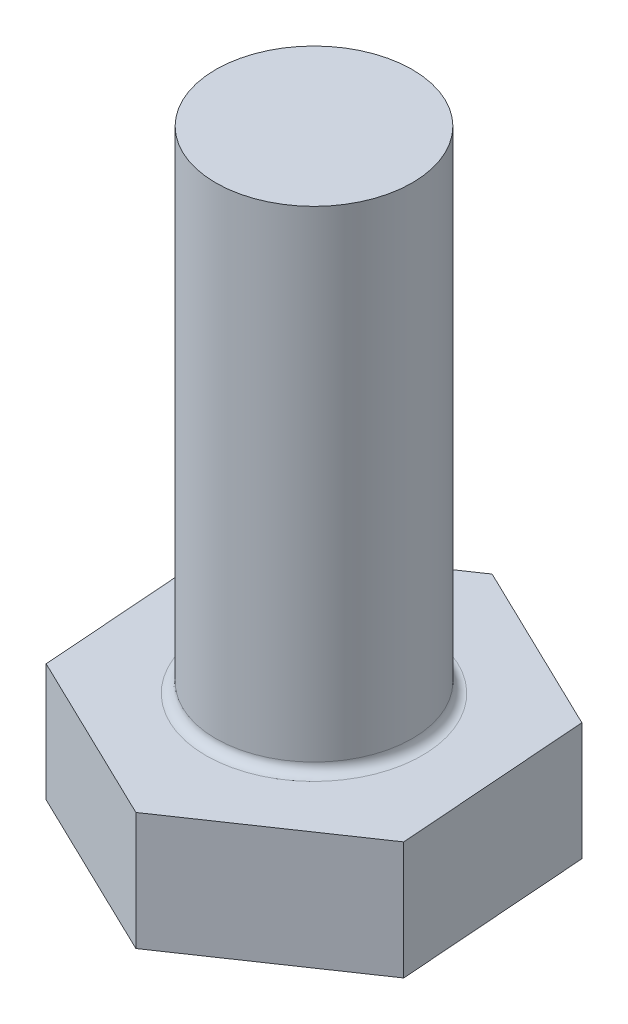
ISO-10303-21;
HEADER;
FILE_DESCRIPTION(('STEP AP214'),'2;1');
FILE_NAME('part.step','',(''),(''),'','','');
FILE_SCHEMA(('AUTOMOTIVE_DESIGN { 1 0 10303 214 1 1 1 1 }'));
ENDSEC;
DATA;
#1=APPLICATION_CONTEXT('core data for automotive mechanical design processes');
#2=APPLICATION_PROTOCOL_DEFINITION('international standard','automotive_design',2000,#1);
#3=PRODUCT_CONTEXT('',#1,'mechanical');
#4=PRODUCT('Part','Part','',(#3));
#5=PRODUCT_RELATED_PRODUCT_CATEGORY('part','',(#4));
#6=PRODUCT_DEFINITION_FORMATION('','',#4);
#7=PRODUCT_DEFINITION_CONTEXT('part definition',#1,'design');
#8=PRODUCT_DEFINITION('design','',#6,#7);
#9=PRODUCT_DEFINITION_SHAPE('','',#8);
#10=(LENGTH_UNIT() NAMED_UNIT(*) SI_UNIT(.MILLI.,.METRE.));
#11=(NAMED_UNIT(*) PLANE_ANGLE_UNIT() SI_UNIT($,.RADIAN.));
#12=(NAMED_UNIT(*) SI_UNIT($,.STERADIAN.) SOLID_ANGLE_UNIT());
#13=UNCERTAINTY_MEASURE_WITH_UNIT(LENGTH_MEASURE(1.E-05),#10,'distance_accuracy_value','');
#14=(GEOMETRIC_REPRESENTATION_CONTEXT(3) GLOBAL_UNCERTAINTY_ASSIGNED_CONTEXT((#13)) GLOBAL_UNIT_ASSIGNED_CONTEXT((#10,
#11,#12)) REPRESENTATION_CONTEXT('',''));
#15=CARTESIAN_POINT('',(0.,0.,0.));
#16=DIRECTION('',(0.,0.,1.));
#17=DIRECTION('',(1.,0.,0.));
#18=AXIS2_PLACEMENT_3D('',#15,#16,#17);
#19=CARTESIAN_POINT('',(0.,25.,0.));
#20=DIRECTION('',(0.,-1.,0.));
#21=DIRECTION('',(0.,0.,-1.));
#22=AXIS2_PLACEMENT_3D('',#19,#20,#21);
#23=CYLINDRICAL_SURFACE('',#22,5.);
#24=CARTESIAN_POINT('',(0.,0.5,0.));
#25=DIRECTION('',(0.,-1.,0.));
#26=DIRECTION('',(0.,0.,-1.));
#27=AXIS2_PLACEMENT_3D('',#24,#25,#26);
#28=CIRCLE('',#27,5.);
#29=CARTESIAN_POINT('',(0.,0.5,-5.));
#30=VERTEX_POINT('',#29);
#31=EDGE_CURVE('E43',#30,#30,#28,.F.);
#32=ORIENTED_EDGE('',*,*,#31,.T.);
#33=EDGE_LOOP('',(#32));
#34=FACE_BOUND('',#33,.T.);
#35=CARTESIAN_POINT('',(0.,25.,0.));
#36=DIRECTION('',(0.,1.,0.));
#37=DIRECTION('',(0.,0.,1.));
#38=AXIS2_PLACEMENT_3D('',#35,#36,#37);
#39=CIRCLE('',#38,5.);
#40=CARTESIAN_POINT('',(0.,25.,5.));
#41=VERTEX_POINT('',#40);
#42=EDGE_CURVE('E139',#41,#41,#39,.T.);
#43=ORIENTED_EDGE('',*,*,#42,.F.);
#44=EDGE_LOOP('',(#43));
#45=FACE_BOUND('',#44,.T.);
#46=ADVANCED_FACE('F34',(#34,#45),#23,.T.);
#47=CARTESIAN_POINT('',(0.,25.,0.));
#48=DIRECTION('',(0.,1.,0.));
#49=DIRECTION('',(0.,0.,1.));
#50=AXIS2_PLACEMENT_3D('',#47,#48,#49);
#51=PLANE('',#50);
#52=ORIENTED_EDGE('',*,*,#42,.T.);
#53=EDGE_LOOP('',(#52));
#54=FACE_BOUND('',#53,.T.);
#55=ADVANCED_FACE('F156',(#54),#51,.T.);
#56=CARTESIAN_POINT('',(8.8375830989077,-6.,4.26971407745699));
#57=DIRECTION('',(-0.562276105316927,0.,-0.826949563993856));
#58=DIRECTION('',(-0.826949563993856,0.,0.562276105316927));
#59=AXIS2_PLACEMENT_3D('',#56,#57,#58);
#60=PLANE('',#59);
#61=DIRECTION('',(-0.826949563993856,0.,0.562276105316927));
#62=VECTOR('',#61,1.);
#63=CARTESIAN_POINT('',(8.8375830989077,0.,4.26971407745699));
#64=LINE('',#63,#62);
#65=CARTESIAN_POINT('',(8.8375830989077,0.,4.26971407745699));
#66=VERTEX_POINT('',#65);
#67=CARTESIAN_POINT('',(0.721110691480059,0.,9.78842851043856));
#68=VERTEX_POINT('',#67);
#69=EDGE_CURVE('E120',#66,#68,#64,.T.);
#70=ORIENTED_EDGE('',*,*,#69,.T.);
#71=DIRECTION('',(0.,1.,0.));
#72=VECTOR('',#71,1.);
#73=CARTESIAN_POINT('',(0.721110691480059,-6.,9.78842851043856));
#74=LINE('',#73,#72);
#75=CARTESIAN_POINT('',(0.721110691480059,-6.,9.78842851043856));
#76=VERTEX_POINT('',#75);
#77=EDGE_CURVE('E137',#76,#68,#74,.T.);
#78=ORIENTED_EDGE('',*,*,#77,.F.);
#79=DIRECTION('',(-0.826949563993856,0.,0.562276105316927));
#80=VECTOR('',#79,1.);
#81=CARTESIAN_POINT('',(8.8375830989077,-6.,4.26971407745699));
#82=LINE('',#81,#80);
#83=CARTESIAN_POINT('',(8.8375830989077,-6.,4.26971407745699));
#84=VERTEX_POINT('',#83);
#85=EDGE_CURVE('E130',#84,#76,#82,.T.);
#86=ORIENTED_EDGE('',*,*,#85,.F.);
#87=DIRECTION('',(0.,1.,0.));
#88=VECTOR('',#87,1.);
#89=CARTESIAN_POINT('',(8.8375830989077,-6.,4.26971407745699));
#90=LINE('',#89,#88);
#91=EDGE_CURVE('E116',#84,#66,#90,.T.);
#92=ORIENTED_EDGE('',*,*,#91,.T.);
#93=EDGE_LOOP('',(#70,#78,#86,#92));
#94=FACE_BOUND('',#93,.T.);
#95=ADVANCED_FACE('F160',(#94),#60,.F.);
#96=CARTESIAN_POINT('',(0.721110691480059,-6.,9.78842851043856));
#97=DIRECTION('',(0.435021277408681,0.,-0.900420173142361));
#98=DIRECTION('',(-0.900420173142361,0.,-0.435021277408681));
#99=AXIS2_PLACEMENT_3D('',#96,#97,#98);
#100=PLANE('',#99);
#101=DIRECTION('',(-0.900420173142361,0.,-0.435021277408681));
#102=VECTOR('',#101,1.);
#103=CARTESIAN_POINT('',(0.721110691480059,0.,9.78842851043856));
#104=LINE('',#103,#102);
#105=CARTESIAN_POINT('',(-8.11647240742763,0.,5.51871443298158));
#106=VERTEX_POINT('',#105);
#107=EDGE_CURVE('E123',#68,#106,#104,.T.);
#108=ORIENTED_EDGE('',*,*,#107,.T.);
#109=DIRECTION('',(0.,1.,0.));
#110=VECTOR('',#109,1.);
#111=CARTESIAN_POINT('',(-8.11647240742763,-6.,5.51871443298158));
#112=LINE('',#111,#110);
#113=CARTESIAN_POINT('',(-8.11647240742763,-6.,5.51871443298158));
#114=VERTEX_POINT('',#113);
#115=EDGE_CURVE('E134',#114,#106,#112,.T.);
#116=ORIENTED_EDGE('',*,*,#115,.F.);
#117=DIRECTION('',(-0.900420173142361,0.,-0.435021277408681));
#118=VECTOR('',#117,1.);
#119=CARTESIAN_POINT('',(0.721110691480059,-6.,9.78842851043856));
#120=LINE('',#119,#118);
#121=EDGE_CURVE('E89',#76,#114,#120,.T.);
#122=ORIENTED_EDGE('',*,*,#121,.F.);
#123=ORIENTED_EDGE('',*,*,#77,.T.);
#124=EDGE_LOOP('',(#108,#116,#122,#123));
#125=FACE_BOUND('',#124,.T.);
#126=ADVANCED_FACE('F166',(#125),#100,.F.);
#127=CARTESIAN_POINT('',(-8.11647240742763,-6.,5.51871443298158));
#128=DIRECTION('',(0.997297382725608,0.,-0.073470609148505));
#129=DIRECTION('',(-0.073470609148505,0.,-0.997297382725608));
#130=AXIS2_PLACEMENT_3D('',#127,#128,#129);
#131=PLANE('',#130);
#132=DIRECTION('',(-0.073470609148505,0.,-0.997297382725608));
#133=VECTOR('',#132,1.);
#134=CARTESIAN_POINT('',(-8.11647240742763,0.,5.51871443298158));
#135=LINE('',#134,#133);
#136=CARTESIAN_POINT('',(-8.83758309890769,0.,-4.26971407745699));
#137=VERTEX_POINT('',#136);
#138=EDGE_CURVE('E125',#106,#137,#135,.T.);
#139=ORIENTED_EDGE('',*,*,#138,.T.);
#140=DIRECTION('',(0.,1.,0.));
#141=VECTOR('',#140,1.);
#142=CARTESIAN_POINT('',(-8.83758309890769,-6.,-4.26971407745699));
#143=LINE('',#142,#141);
#144=CARTESIAN_POINT('',(-8.83758309890769,-6.,-4.26971407745699));
#145=VERTEX_POINT('',#144);
#146=EDGE_CURVE('E111',#145,#137,#143,.T.);
#147=ORIENTED_EDGE('',*,*,#146,.F.);
#148=DIRECTION('',(-0.073470609148505,0.,-0.997297382725608));
#149=VECTOR('',#148,1.);
#150=CARTESIAN_POINT('',(-8.11647240742763,-6.,5.51871443298158));
#151=LINE('',#150,#149);
#152=EDGE_CURVE('E102',#114,#145,#151,.T.);
#153=ORIENTED_EDGE('',*,*,#152,.F.);
#154=ORIENTED_EDGE('',*,*,#115,.T.);
#155=EDGE_LOOP('',(#139,#147,#153,#154));
#156=FACE_BOUND('',#155,.T.);
#157=ADVANCED_FACE('F170',(#156),#131,.F.);
#158=CARTESIAN_POINT('',(-8.83758309890769,-6.,-4.26971407745699));
#159=DIRECTION('',(0.562276105316927,0.,0.826949563993856));
#160=DIRECTION('',(0.826949563993856,0.,-0.562276105316927));
#161=AXIS2_PLACEMENT_3D('',#158,#159,#160);
#162=PLANE('',#161);
#163=DIRECTION('',(0.826949563993856,0.,-0.562276105316927));
#164=VECTOR('',#163,1.);
#165=CARTESIAN_POINT('',(-8.83758309890769,0.,-4.26971407745699));
#166=LINE('',#165,#164);
#167=CARTESIAN_POINT('',(-0.721110691480053,0.,-9.78842851043856));
#168=VERTEX_POINT('',#167);
#169=EDGE_CURVE('E110',#137,#168,#166,.T.);
#170=ORIENTED_EDGE('',*,*,#169,.T.);
#171=DIRECTION('',(0.,1.,0.));
#172=VECTOR('',#171,1.);
#173=CARTESIAN_POINT('',(-0.721110691480053,-6.,-9.78842851043856));
#174=LINE('',#173,#172);
#175=CARTESIAN_POINT('',(-0.721110691480053,-6.,-9.78842851043856));
#176=VERTEX_POINT('',#175);
#177=EDGE_CURVE('E107',#176,#168,#174,.T.);
#178=ORIENTED_EDGE('',*,*,#177,.F.);
#179=DIRECTION('',(0.826949563993856,0.,-0.562276105316927));
#180=VECTOR('',#179,1.);
#181=CARTESIAN_POINT('',(-8.83758309890769,-6.,-4.26971407745699));
#182=LINE('',#181,#180);
#183=EDGE_CURVE('E96',#145,#176,#182,.T.);
#184=ORIENTED_EDGE('',*,*,#183,.F.);
#185=ORIENTED_EDGE('',*,*,#146,.T.);
#186=EDGE_LOOP('',(#170,#178,#184,#185));
#187=FACE_BOUND('',#186,.T.);
#188=ADVANCED_FACE('F108',(#187),#162,.F.);
#189=CARTESIAN_POINT('',(-0.721110691480053,-6.,-9.78842851043856));
#190=DIRECTION('',(-0.435021277408681,0.,0.900420173142361));
#191=DIRECTION('',(0.900420173142361,0.,0.435021277408681));
#192=AXIS2_PLACEMENT_3D('',#189,#190,#191);
#193=PLANE('',#192);
#194=DIRECTION('',(0.900420173142361,0.,0.435021277408681));
#195=VECTOR('',#194,1.);
#196=CARTESIAN_POINT('',(-0.721110691480053,0.,-9.78842851043856));
#197=LINE('',#196,#195);
#198=CARTESIAN_POINT('',(8.11647240742764,0.,-5.51871443298158));
#199=VERTEX_POINT('',#198);
#200=EDGE_CURVE('E74',#168,#199,#197,.T.);
#201=ORIENTED_EDGE('',*,*,#200,.T.);
#202=DIRECTION('',(0.,1.,0.));
#203=VECTOR('',#202,1.);
#204=CARTESIAN_POINT('',(8.11647240742764,-6.,-5.51871443298158));
#205=LINE('',#204,#203);
#206=CARTESIAN_POINT('',(8.11647240742764,-6.,-5.51871443298158));
#207=VERTEX_POINT('',#206);
#208=EDGE_CURVE('E112',#207,#199,#205,.T.);
#209=ORIENTED_EDGE('',*,*,#208,.F.);
#210=DIRECTION('',(0.900420173142361,0.,0.435021277408681));
#211=VECTOR('',#210,1.);
#212=CARTESIAN_POINT('',(-0.721110691480053,-6.,-9.78842851043856));
#213=LINE('',#212,#211);
#214=EDGE_CURVE('E100',#176,#207,#213,.T.);
#215=ORIENTED_EDGE('',*,*,#214,.F.);
#216=ORIENTED_EDGE('',*,*,#177,.T.);
#217=EDGE_LOOP('',(#201,#209,#215,#216));
#218=FACE_BOUND('',#217,.T.);
#219=ADVANCED_FACE('F114',(#218),#193,.F.);
#220=CARTESIAN_POINT('',(8.11647240742764,-6.,-5.51871443298158));
#221=DIRECTION('',(-0.997297382725608,0.,0.0734706091485052));
#222=DIRECTION('',(0.0734706091485052,0.,0.997297382725608));
#223=AXIS2_PLACEMENT_3D('',#220,#221,#222);
#224=PLANE('',#223);
#225=DIRECTION('',(0.0734706091485052,0.,0.997297382725608));
#226=VECTOR('',#225,1.);
#227=CARTESIAN_POINT('',(8.11647240742764,0.,-5.51871443298158));
#228=LINE('',#227,#226);
#229=EDGE_CURVE('E80',#199,#66,#228,.T.);
#230=ORIENTED_EDGE('',*,*,#229,.T.);
#231=ORIENTED_EDGE('',*,*,#91,.F.);
#232=DIRECTION('',(0.0734706091485052,0.,0.997297382725608));
#233=VECTOR('',#232,1.);
#234=CARTESIAN_POINT('',(8.11647240742764,-6.,-5.51871443298158));
#235=LINE('',#234,#233);
#236=EDGE_CURVE('E51',#207,#84,#235,.T.);
#237=ORIENTED_EDGE('',*,*,#236,.F.);
#238=ORIENTED_EDGE('',*,*,#208,.T.);
#239=EDGE_LOOP('',(#230,#231,#237,#238));
#240=FACE_BOUND('',#239,.T.);
#241=ADVANCED_FACE('F178',(#240),#224,.F.);
#242=CARTESIAN_POINT('',(0.,-6.,0.));
#243=DIRECTION('',(0.,-1.,0.));
#244=DIRECTION('',(0.,0.,-1.));
#245=AXIS2_PLACEMENT_3D('',#242,#243,#244);
#246=PLANE('',#245);
#247=ORIENTED_EDGE('',*,*,#85,.T.);
#248=ORIENTED_EDGE('',*,*,#121,.T.);
#249=ORIENTED_EDGE('',*,*,#152,.T.);
#250=ORIENTED_EDGE('',*,*,#183,.T.);
#251=ORIENTED_EDGE('',*,*,#214,.T.);
#252=ORIENTED_EDGE('',*,*,#236,.T.);
#253=EDGE_LOOP('',(#247,#248,#249,#250,#251,#252));
#254=FACE_BOUND('',#253,.T.);
#255=ADVANCED_FACE('F98',(#254),#246,.T.);
#256=CARTESIAN_POINT('',(0.,0.,0.));
#257=DIRECTION('',(0.,-1.,0.));
#258=DIRECTION('',(0.,0.,-1.));
#259=AXIS2_PLACEMENT_3D('',#256,#257,#258);
#260=PLANE('',#259);
#261=CARTESIAN_POINT('',(0.,0.,0.));
#262=DIRECTION('',(0.,-1.,0.));
#263=DIRECTION('',(0.,0.,-1.));
#264=AXIS2_PLACEMENT_3D('',#261,#262,#263);
#265=CIRCLE('',#264,5.5);
#266=CARTESIAN_POINT('',(0.,0.,-5.5));
#267=VERTEX_POINT('',#266);
#268=EDGE_CURVE('E11',#267,#267,#265,.T.);
#269=ORIENTED_EDGE('',*,*,#268,.T.);
#270=EDGE_LOOP('',(#269));
#271=FACE_BOUND('',#270,.T.);
#272=ORIENTED_EDGE('',*,*,#69,.F.);
#273=ORIENTED_EDGE('',*,*,#229,.F.);
#274=ORIENTED_EDGE('',*,*,#200,.F.);
#275=ORIENTED_EDGE('',*,*,#169,.F.);
#276=ORIENTED_EDGE('',*,*,#138,.F.);
#277=ORIENTED_EDGE('',*,*,#107,.F.);
#278=EDGE_LOOP('',(#272,#273,#274,#275,#276,#277));
#279=FACE_BOUND('',#278,.T.);
#280=ADVANCED_FACE('F147',(#271,#279),#260,.F.);
#281=CARTESIAN_POINT('',(0.,0.5,0.));
#282=DIRECTION('',(0.,-1.,0.));
#283=DIRECTION('',(0.,0.,-1.));
#284=AXIS2_PLACEMENT_3D('',#281,#282,#283);
#285=TOROIDAL_SURFACE('',#284,5.5,0.5);
#286=ORIENTED_EDGE('',*,*,#268,.F.);
#287=EDGE_LOOP('',(#286));
#288=FACE_BOUND('',#287,.T.);
#289=ORIENTED_EDGE('',*,*,#31,.F.);
#290=EDGE_LOOP('',(#289));
#291=FACE_BOUND('',#290,.T.);
#292=ADVANCED_FACE('F36',(#288,#291),#285,.F.);
#293=CLOSED_SHELL('',(#46,#55,#95,#126,#157,#188,#219,#241,#255,#280,#292));
#294=MANIFOLD_SOLID_BREP('B2',#293);
#295=ADVANCED_BREP_SHAPE_REPRESENTATION('',(#18,#294),#14);
#296=SHAPE_DEFINITION_REPRESENTATION(#9,#295);
ENDSEC;
END-ISO-10303-21;
